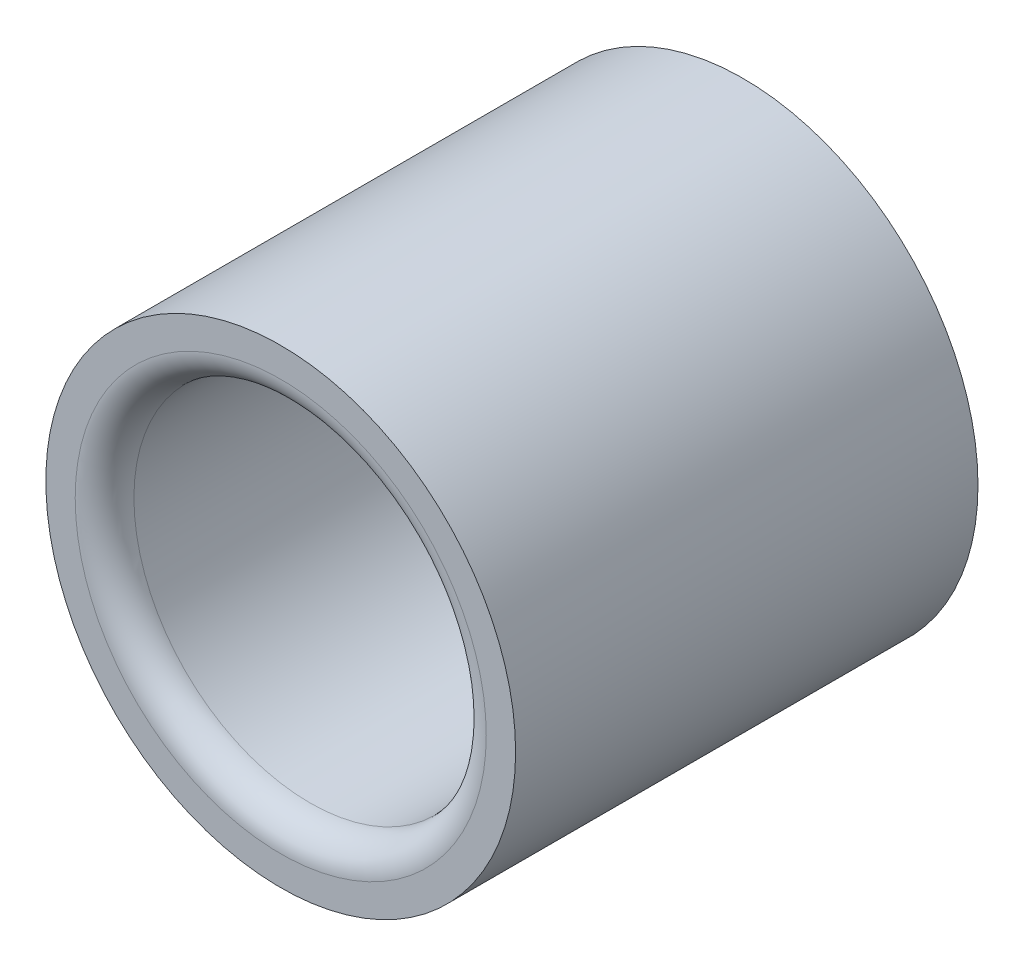
ISO-10303-21;
HEADER;
FILE_DESCRIPTION(('STEP AP214'),'2;1');
FILE_NAME('part.step','',(''),(''),'','','');
FILE_SCHEMA(('AUTOMOTIVE_DESIGN { 1 0 10303 214 1 1 1 1 }'));
ENDSEC;
DATA;
#1=APPLICATION_CONTEXT('core data for automotive mechanical design processes');
#2=APPLICATION_PROTOCOL_DEFINITION('international standard','automotive_design',2000,#1);
#3=PRODUCT_CONTEXT('',#1,'mechanical');
#4=PRODUCT('Part','Part','',(#3));
#5=PRODUCT_RELATED_PRODUCT_CATEGORY('part','',(#4));
#6=PRODUCT_DEFINITION_FORMATION('','',#4);
#7=PRODUCT_DEFINITION_CONTEXT('part definition',#1,'design');
#8=PRODUCT_DEFINITION('design','',#6,#7);
#9=PRODUCT_DEFINITION_SHAPE('','',#8);
#10=(LENGTH_UNIT() NAMED_UNIT(*) SI_UNIT(.MILLI.,.METRE.));
#11=(NAMED_UNIT(*) PLANE_ANGLE_UNIT() SI_UNIT($,.RADIAN.));
#12=(NAMED_UNIT(*) SI_UNIT($,.STERADIAN.) SOLID_ANGLE_UNIT());
#13=UNCERTAINTY_MEASURE_WITH_UNIT(LENGTH_MEASURE(1.E-05),#10,'distance_accuracy_value','');
#14=(GEOMETRIC_REPRESENTATION_CONTEXT(3) GLOBAL_UNCERTAINTY_ASSIGNED_CONTEXT((#13)) GLOBAL_UNIT_ASSIGNED_CONTEXT((#10,
#11,#12)) REPRESENTATION_CONTEXT('',''));
#15=CARTESIAN_POINT('',(0.,0.,0.));
#16=DIRECTION('',(0.,0.,1.));
#17=DIRECTION('',(1.,0.,0.));
#18=AXIS2_PLACEMENT_3D('',#15,#16,#17);
#19=CARTESIAN_POINT('',(0.,0.,2.5));
#20=DIRECTION('',(0.,0.,1.));
#21=DIRECTION('',(1.,0.,0.));
#22=AXIS2_PLACEMENT_3D('',#19,#20,#21);
#23=PLANE('',#22);
#24=CARTESIAN_POINT('',(0.,0.,2.5));
#25=DIRECTION('',(0.,0.,1.));
#26=DIRECTION('',(1.,0.,0.));
#27=AXIS2_PLACEMENT_3D('',#24,#25,#26);
#28=CIRCLE('',#27,1.11125);
#29=CARTESIAN_POINT('',(1.11125,0.,2.5));
#30=VERTEX_POINT('',#29);
#31=EDGE_CURVE('E38',#30,#30,#28,.F.);
#32=ORIENTED_EDGE('',*,*,#31,.T.);
#33=EDGE_LOOP('',(#32));
#34=FACE_BOUND('',#33,.T.);
#35=CARTESIAN_POINT('',(0.,0.,2.5));
#36=DIRECTION('',(0.,0.,1.));
#37=DIRECTION('',(1.,0.,0.));
#38=AXIS2_PLACEMENT_3D('',#35,#36,#37);
#39=CIRCLE('',#38,1.27);
#40=CARTESIAN_POINT('',(1.27,0.,2.5));
#41=VERTEX_POINT('',#40);
#42=EDGE_CURVE('E51',#41,#41,#39,.T.);
#43=ORIENTED_EDGE('',*,*,#42,.T.);
#44=EDGE_LOOP('',(#43));
#45=FACE_BOUND('',#44,.T.);
#46=ADVANCED_FACE('F31',(#34,#45),#23,.T.);
#47=CARTESIAN_POINT('',(0.,0.,0.));
#48=DIRECTION('',(0.,0.,1.));
#49=DIRECTION('',(1.,0.,0.));
#50=AXIS2_PLACEMENT_3D('',#47,#48,#49);
#51=PLANE('',#50);
#52=CARTESIAN_POINT('',(0.,0.,0.));
#53=DIRECTION('',(0.,0.,1.));
#54=DIRECTION('',(1.,0.,0.));
#55=AXIS2_PLACEMENT_3D('',#52,#53,#54);
#56=CIRCLE('',#55,1.11125);
#57=CARTESIAN_POINT('',(1.11125,0.,0.));
#58=VERTEX_POINT('',#57);
#59=EDGE_CURVE('E10',#58,#58,#56,.T.);
#60=ORIENTED_EDGE('',*,*,#59,.T.);
#61=EDGE_LOOP('',(#60));
#62=FACE_BOUND('',#61,.T.);
#63=CARTESIAN_POINT('',(0.,0.,0.));
#64=DIRECTION('',(0.,0.,1.));
#65=DIRECTION('',(1.,0.,0.));
#66=AXIS2_PLACEMENT_3D('',#63,#64,#65);
#67=CIRCLE('',#66,1.27);
#68=CARTESIAN_POINT('',(1.27,0.,0.));
#69=VERTEX_POINT('',#68);
#70=EDGE_CURVE('E52',#69,#69,#67,.T.);
#71=ORIENTED_EDGE('',*,*,#70,.F.);
#72=EDGE_LOOP('',(#71));
#73=FACE_BOUND('',#72,.T.);
#74=ADVANCED_FACE('F63',(#62,#73),#51,.F.);
#75=CARTESIAN_POINT('',(0.,0.,2.5));
#76=DIRECTION('',(0.,0.,-1.));
#77=DIRECTION('',(-1.,0.,0.));
#78=AXIS2_PLACEMENT_3D('',#75,#76,#77);
#79=CYLINDRICAL_SURFACE('',#78,1.27);
#80=ORIENTED_EDGE('',*,*,#42,.F.);
#81=EDGE_LOOP('',(#80));
#82=FACE_BOUND('',#81,.T.);
#83=ORIENTED_EDGE('',*,*,#70,.T.);
#84=EDGE_LOOP('',(#83));
#85=FACE_BOUND('',#84,.T.);
#86=ADVANCED_FACE('F59',(#82,#85),#79,.T.);
#87=CARTESIAN_POINT('',(0.,0.,2.5));
#88=DIRECTION('',(0.,0.,-1.));
#89=DIRECTION('',(-1.,0.,0.));
#90=AXIS2_PLACEMENT_3D('',#87,#88,#89);
#91=CYLINDRICAL_SURFACE('',#90,0.9525);
#92=CARTESIAN_POINT('',(0.,0.,2.34125));
#93=DIRECTION('',(0.,0.,1.));
#94=DIRECTION('',(1.,0.,0.));
#95=AXIS2_PLACEMENT_3D('',#92,#93,#94);
#96=CIRCLE('',#95,0.9525);
#97=CARTESIAN_POINT('',(0.9525,0.,2.34125));
#98=VERTEX_POINT('',#97);
#99=EDGE_CURVE('E42',#98,#98,#96,.T.);
#100=ORIENTED_EDGE('',*,*,#99,.T.);
#101=EDGE_LOOP('',(#100));
#102=FACE_BOUND('',#101,.T.);
#103=CARTESIAN_POINT('',(0.,0.,0.15875));
#104=DIRECTION('',(0.,0.,1.));
#105=DIRECTION('',(1.,0.,0.));
#106=AXIS2_PLACEMENT_3D('',#103,#104,#105);
#107=CIRCLE('',#106,0.9525);
#108=CARTESIAN_POINT('',(0.9525,0.,0.15875));
#109=VERTEX_POINT('',#108);
#110=EDGE_CURVE('E46',#109,#109,#107,.F.);
#111=ORIENTED_EDGE('',*,*,#110,.T.);
#112=EDGE_LOOP('',(#111));
#113=FACE_BOUND('',#112,.T.);
#114=ADVANCED_FACE('F62',(#102,#113),#91,.F.);
#115=CARTESIAN_POINT('',(0.,0.,2.34125));
#116=DIRECTION('',(0.,0.,1.));
#117=DIRECTION('',(1.,0.,0.));
#118=AXIS2_PLACEMENT_3D('',#115,#116,#117);
#119=TOROIDAL_SURFACE('',#118,1.11125,0.15875);
#120=ORIENTED_EDGE('',*,*,#31,.F.);
#121=EDGE_LOOP('',(#120));
#122=FACE_BOUND('',#121,.T.);
#123=ORIENTED_EDGE('',*,*,#99,.F.);
#124=EDGE_LOOP('',(#123));
#125=FACE_BOUND('',#124,.T.);
#126=ADVANCED_FACE('F74',(#122,#125),#119,.T.);
#127=CARTESIAN_POINT('',(0.,0.,0.15875));
#128=DIRECTION('',(0.,0.,1.));
#129=DIRECTION('',(1.,0.,0.));
#130=AXIS2_PLACEMENT_3D('',#127,#128,#129);
#131=TOROIDAL_SURFACE('',#130,1.11125,0.15875);
#132=ORIENTED_EDGE('',*,*,#110,.F.);
#133=EDGE_LOOP('',(#132));
#134=FACE_BOUND('',#133,.T.);
#135=ORIENTED_EDGE('',*,*,#59,.F.);
#136=EDGE_LOOP('',(#135));
#137=FACE_BOUND('',#136,.T.);
#138=ADVANCED_FACE('F33',(#134,#137),#131,.T.);
#139=CLOSED_SHELL('',(#46,#74,#86,#114,#126,#138));
#140=MANIFOLD_SOLID_BREP('B2',#139);
#141=ADVANCED_BREP_SHAPE_REPRESENTATION('',(#18,#140),#14);
#142=SHAPE_DEFINITION_REPRESENTATION(#9,#141);
ENDSEC;
END-ISO-10303-21;
